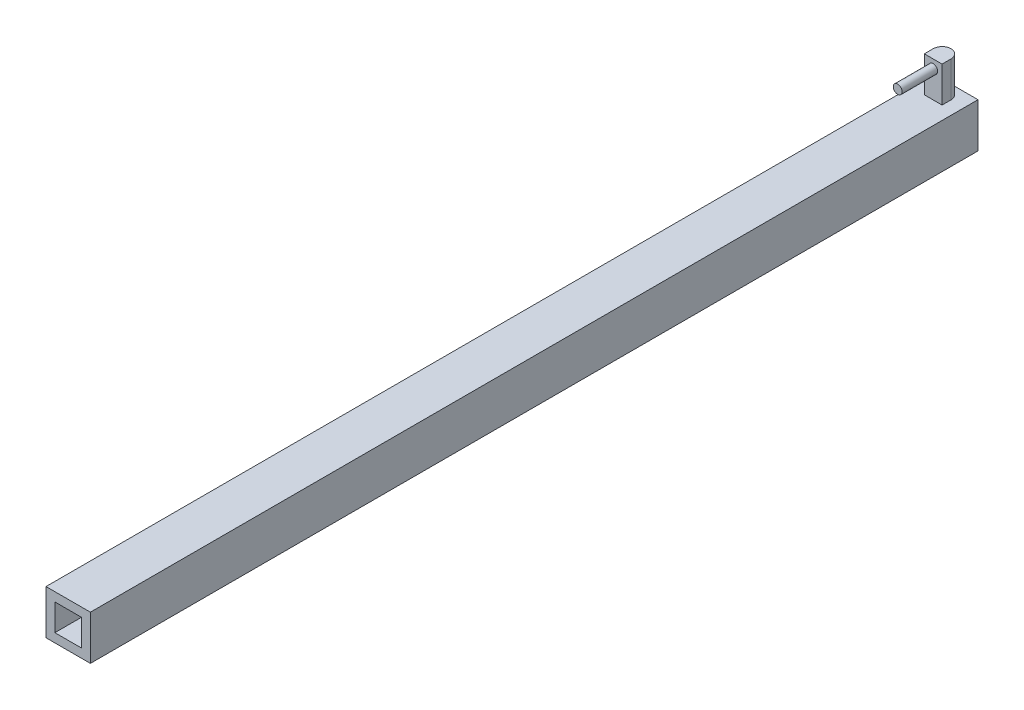
ISO-10303-21;
HEADER;
FILE_DESCRIPTION(('STEP AP214'),'2;1');
FILE_NAME('part.step','',(''),(''),'','','');
FILE_SCHEMA(('AUTOMOTIVE_DESIGN { 1 0 10303 214 1 1 1 1 }'));
ENDSEC;
DATA;
#1=APPLICATION_CONTEXT('core data for automotive mechanical design processes');
#2=APPLICATION_PROTOCOL_DEFINITION('international standard','automotive_design',2000,#1);
#3=PRODUCT_CONTEXT('',#1,'mechanical');
#4=PRODUCT('Part','Part','',(#3));
#5=PRODUCT_RELATED_PRODUCT_CATEGORY('part','',(#4));
#6=PRODUCT_DEFINITION_FORMATION('','',#4);
#7=PRODUCT_DEFINITION_CONTEXT('part definition',#1,'design');
#8=PRODUCT_DEFINITION('design','',#6,#7);
#9=PRODUCT_DEFINITION_SHAPE('','',#8);
#10=(LENGTH_UNIT() NAMED_UNIT(*) SI_UNIT(.MILLI.,.METRE.));
#11=(NAMED_UNIT(*) PLANE_ANGLE_UNIT() SI_UNIT($,.RADIAN.));
#12=(NAMED_UNIT(*) SI_UNIT($,.STERADIAN.) SOLID_ANGLE_UNIT());
#13=UNCERTAINTY_MEASURE_WITH_UNIT(LENGTH_MEASURE(1.E-05),#10,'distance_accuracy_value','');
#14=(GEOMETRIC_REPRESENTATION_CONTEXT(3) GLOBAL_UNCERTAINTY_ASSIGNED_CONTEXT((#13)) GLOBAL_UNIT_ASSIGNED_CONTEXT((#10,
#11,#12)) REPRESENTATION_CONTEXT('',''));
#15=CARTESIAN_POINT('',(0.,0.,0.));
#16=DIRECTION('',(0.,0.,1.));
#17=DIRECTION('',(1.,0.,0.));
#18=AXIS2_PLACEMENT_3D('',#15,#16,#17);
#19=CARTESIAN_POINT('',(-12.5,12.5,500.));
#20=DIRECTION('',(0.,-1.,0.));
#21=DIRECTION('',(0.,0.,-1.));
#22=AXIS2_PLACEMENT_3D('',#19,#20,#21);
#23=PLANE('',#22);
#24=DIRECTION('',(-1.,0.,0.));
#25=VECTOR('',#24,1.);
#26=CARTESIAN_POINT('',(-12.5,12.5,0.));
#27=LINE('',#26,#25);
#28=CARTESIAN_POINT('',(12.5,12.5,0.));
#29=VERTEX_POINT('',#28);
#30=CARTESIAN_POINT('',(-12.5,12.5,0.));
#31=VERTEX_POINT('',#30);
#32=EDGE_CURVE('E219',#29,#31,#27,.T.);
#33=ORIENTED_EDGE('',*,*,#32,.T.);
#34=DIRECTION('',(0.,0.,-1.));
#35=VECTOR('',#34,1.);
#36=CARTESIAN_POINT('',(-12.5,12.5,500.));
#37=LINE('',#36,#35);
#38=CARTESIAN_POINT('',(-12.5,12.5,500.));
#39=VERTEX_POINT('',#38);
#40=EDGE_CURVE('E228',#39,#31,#37,.T.);
#41=ORIENTED_EDGE('',*,*,#40,.F.);
#42=DIRECTION('',(-1.,0.,0.));
#43=VECTOR('',#42,1.);
#44=CARTESIAN_POINT('',(-12.5,12.5,500.));
#45=LINE('',#44,#43);
#46=CARTESIAN_POINT('',(12.5,12.5,500.));
#47=VERTEX_POINT('',#46);
#48=EDGE_CURVE('E225',#47,#39,#45,.T.);
#49=ORIENTED_EDGE('',*,*,#48,.F.);
#50=DIRECTION('',(0.,0.,-1.));
#51=VECTOR('',#50,1.);
#52=CARTESIAN_POINT('',(12.5,12.5,500.));
#53=LINE('',#52,#51);
#54=EDGE_CURVE('E243',#47,#29,#53,.T.);
#55=ORIENTED_EDGE('',*,*,#54,.T.);
#56=EDGE_LOOP('',(#33,#41,#49,#55));
#57=FACE_BOUND('',#56,.T.);
#58=DIRECTION('',(0.,0.,-1.));
#59=VECTOR('',#58,1.);
#60=CARTESIAN_POINT('',(5.,12.5,12.731161072987));
#61=LINE('',#60,#59);
#62=CARTESIAN_POINT('',(5.,12.5,12.731161072987));
#63=VERTEX_POINT('',#62);
#64=CARTESIAN_POINT('',(5.,12.5,7.73116107298702));
#65=VERTEX_POINT('',#64);
#66=EDGE_CURVE('E161',#63,#65,#61,.T.);
#67=ORIENTED_EDGE('',*,*,#66,.F.);
#68=DIRECTION('',(1.,0.,0.));
#69=VECTOR('',#68,1.);
#70=CARTESIAN_POINT('',(-5.,12.5,12.731161072987));
#71=LINE('',#70,#69);
#72=CARTESIAN_POINT('',(-5.,12.5,12.731161072987));
#73=VERTEX_POINT('',#72);
#74=EDGE_CURVE('E168',#73,#63,#71,.T.);
#75=ORIENTED_EDGE('',*,*,#74,.F.);
#76=DIRECTION('',(0.,0.,1.));
#77=VECTOR('',#76,1.);
#78=CARTESIAN_POINT('',(-5.,12.5,12.731161072987));
#79=LINE('',#78,#77);
#80=CARTESIAN_POINT('',(-5.,12.5,7.73116107298702));
#81=VERTEX_POINT('',#80);
#82=EDGE_CURVE('E144',#81,#73,#79,.T.);
#83=ORIENTED_EDGE('',*,*,#82,.F.);
#84=CARTESIAN_POINT('',(0.,12.5,7.73116107298702));
#85=DIRECTION('',(0.,-1.,0.));
#86=DIRECTION('',(0.,0.,-1.));
#87=AXIS2_PLACEMENT_3D('',#84,#85,#86);
#88=CIRCLE('',#87,5.);
#89=CARTESIAN_POINT('',(0.,12.5,2.73116107298702));
#90=VERTEX_POINT('',#89);
#91=EDGE_CURVE('E11',#81,#90,#88,.T.);
#92=ORIENTED_EDGE('',*,*,#91,.T.);
#93=CARTESIAN_POINT('',(0.,12.5,7.73116107298702));
#94=DIRECTION('',(0.,-1.,0.));
#95=DIRECTION('',(0.,0.,-1.));
#96=AXIS2_PLACEMENT_3D('',#93,#94,#95);
#97=CIRCLE('',#96,5.);
#98=EDGE_CURVE('E268',#90,#65,#97,.T.);
#99=ORIENTED_EDGE('',*,*,#98,.T.);
#100=EDGE_LOOP('',(#67,#75,#83,#92,#99));
#101=FACE_BOUND('',#100,.T.);
#102=ADVANCED_FACE('F38',(#57,#101),#23,.F.);
#103=CARTESIAN_POINT('',(0.,0.,500.));
#104=DIRECTION('',(0.,0.,-1.));
#105=DIRECTION('',(-1.,0.,0.));
#106=AXIS2_PLACEMENT_3D('',#103,#104,#105);
#107=PLANE('',#106);
#108=DIRECTION('',(0.,-1.,0.));
#109=VECTOR('',#108,1.);
#110=CARTESIAN_POINT('',(-12.5,-12.5,500.));
#111=LINE('',#110,#109);
#112=CARTESIAN_POINT('',(-12.5,-12.5,500.));
#113=VERTEX_POINT('',#112);
#114=EDGE_CURVE('E214',#39,#113,#111,.T.);
#115=ORIENTED_EDGE('',*,*,#114,.T.);
#116=DIRECTION('',(1.,0.,0.));
#117=VECTOR('',#116,1.);
#118=CARTESIAN_POINT('',(-12.5,-12.5,500.));
#119=LINE('',#118,#117);
#120=CARTESIAN_POINT('',(12.5,-12.5,500.));
#121=VERTEX_POINT('',#120);
#122=EDGE_CURVE('E218',#113,#121,#119,.T.);
#123=ORIENTED_EDGE('',*,*,#122,.T.);
#124=DIRECTION('',(0.,1.,0.));
#125=VECTOR('',#124,1.);
#126=CARTESIAN_POINT('',(12.5,-12.5,500.));
#127=LINE('',#126,#125);
#128=EDGE_CURVE('E222',#121,#47,#127,.T.);
#129=ORIENTED_EDGE('',*,*,#128,.T.);
#130=ORIENTED_EDGE('',*,*,#48,.T.);
#131=EDGE_LOOP('',(#115,#123,#129,#130));
#132=FACE_BOUND('',#131,.T.);
#133=DIRECTION('',(0.,1.,0.));
#134=VECTOR('',#133,1.);
#135=CARTESIAN_POINT('',(7.5,-7.5,500.));
#136=LINE('',#135,#134);
#137=CARTESIAN_POINT('',(7.5,-7.5,500.));
#138=VERTEX_POINT('',#137);
#139=CARTESIAN_POINT('',(7.5,7.5,500.));
#140=VERTEX_POINT('',#139);
#141=EDGE_CURVE('E171',#138,#140,#136,.T.);
#142=ORIENTED_EDGE('',*,*,#141,.F.);
#143=DIRECTION('',(1.,0.,0.));
#144=VECTOR('',#143,1.);
#145=CARTESIAN_POINT('',(-7.5,-7.5,500.));
#146=LINE('',#145,#144);
#147=CARTESIAN_POINT('',(-7.5,-7.5,500.));
#148=VERTEX_POINT('',#147);
#149=EDGE_CURVE('E182',#148,#138,#146,.T.);
#150=ORIENTED_EDGE('',*,*,#149,.F.);
#151=DIRECTION('',(0.,-1.,0.));
#152=VECTOR('',#151,1.);
#153=CARTESIAN_POINT('',(-7.5,-7.5,500.));
#154=LINE('',#153,#152);
#155=CARTESIAN_POINT('',(-7.5,7.5,500.));
#156=VERTEX_POINT('',#155);
#157=EDGE_CURVE('E178',#156,#148,#154,.T.);
#158=ORIENTED_EDGE('',*,*,#157,.F.);
#159=DIRECTION('',(-1.,0.,0.));
#160=VECTOR('',#159,1.);
#161=CARTESIAN_POINT('',(-7.5,7.5,500.));
#162=LINE('',#161,#160);
#163=EDGE_CURVE('E174',#140,#156,#162,.T.);
#164=ORIENTED_EDGE('',*,*,#163,.F.);
#165=EDGE_LOOP('',(#142,#150,#158,#164));
#166=FACE_BOUND('',#165,.T.);
#167=ADVANCED_FACE('F326',(#132,#166),#107,.F.);
#168=CARTESIAN_POINT('',(0.,0.,0.));
#169=DIRECTION('',(0.,0.,-1.));
#170=DIRECTION('',(-1.,0.,0.));
#171=AXIS2_PLACEMENT_3D('',#168,#169,#170);
#172=PLANE('',#171);
#173=DIRECTION('',(0.,-1.,0.));
#174=VECTOR('',#173,1.);
#175=CARTESIAN_POINT('',(-12.5,-12.5,0.));
#176=LINE('',#175,#174);
#177=CARTESIAN_POINT('',(-12.5,-12.5,0.));
#178=VERTEX_POINT('',#177);
#179=EDGE_CURVE('E213',#31,#178,#176,.T.);
#180=ORIENTED_EDGE('',*,*,#179,.F.);
#181=ORIENTED_EDGE('',*,*,#32,.F.);
#182=DIRECTION('',(0.,1.,0.));
#183=VECTOR('',#182,1.);
#184=CARTESIAN_POINT('',(12.5,-12.5,0.));
#185=LINE('',#184,#183);
#186=CARTESIAN_POINT('',(12.5,-12.5,0.));
#187=VERTEX_POINT('',#186);
#188=EDGE_CURVE('E235',#187,#29,#185,.T.);
#189=ORIENTED_EDGE('',*,*,#188,.F.);
#190=DIRECTION('',(1.,0.,0.));
#191=VECTOR('',#190,1.);
#192=CARTESIAN_POINT('',(-12.5,-12.5,0.));
#193=LINE('',#192,#191);
#194=EDGE_CURVE('E232',#178,#187,#193,.T.);
#195=ORIENTED_EDGE('',*,*,#194,.F.);
#196=EDGE_LOOP('',(#180,#181,#189,#195));
#197=FACE_BOUND('',#196,.T.);
#198=DIRECTION('',(1.,0.,0.));
#199=VECTOR('',#198,1.);
#200=CARTESIAN_POINT('',(-7.5,-7.5,0.));
#201=LINE('',#200,#199);
#202=CARTESIAN_POINT('',(-7.5,-7.5,0.));
#203=VERTEX_POINT('',#202);
#204=CARTESIAN_POINT('',(7.5,-7.5,0.));
#205=VERTEX_POINT('',#204);
#206=EDGE_CURVE('E175',#203,#205,#201,.T.);
#207=ORIENTED_EDGE('',*,*,#206,.T.);
#208=DIRECTION('',(0.,1.,0.));
#209=VECTOR('',#208,1.);
#210=CARTESIAN_POINT('',(7.5,-7.5,0.));
#211=LINE('',#210,#209);
#212=CARTESIAN_POINT('',(7.5,7.5,0.));
#213=VERTEX_POINT('',#212);
#214=EDGE_CURVE('E149',#205,#213,#211,.T.);
#215=ORIENTED_EDGE('',*,*,#214,.T.);
#216=DIRECTION('',(-1.,0.,0.));
#217=VECTOR('',#216,1.);
#218=CARTESIAN_POINT('',(-7.5,7.5,0.));
#219=LINE('',#218,#217);
#220=CARTESIAN_POINT('',(-7.5,7.5,0.));
#221=VERTEX_POINT('',#220);
#222=EDGE_CURVE('E189',#213,#221,#219,.T.);
#223=ORIENTED_EDGE('',*,*,#222,.T.);
#224=DIRECTION('',(0.,-1.,0.));
#225=VECTOR('',#224,1.);
#226=CARTESIAN_POINT('',(-7.5,-7.5,0.));
#227=LINE('',#226,#225);
#228=EDGE_CURVE('E193',#221,#203,#227,.T.);
#229=ORIENTED_EDGE('',*,*,#228,.T.);
#230=EDGE_LOOP('',(#207,#215,#223,#229));
#231=FACE_BOUND('',#230,.T.);
#232=ADVANCED_FACE('F318',(#197,#231),#172,.T.);
#233=CARTESIAN_POINT('',(-12.5,-12.5,500.));
#234=DIRECTION('',(1.,0.,0.));
#235=DIRECTION('',(0.,0.,-1.));
#236=AXIS2_PLACEMENT_3D('',#233,#234,#235);
#237=PLANE('',#236);
#238=ORIENTED_EDGE('',*,*,#179,.T.);
#239=DIRECTION('',(0.,0.,-1.));
#240=VECTOR('',#239,1.);
#241=CARTESIAN_POINT('',(-12.5,-12.5,500.));
#242=LINE('',#241,#240);
#243=EDGE_CURVE('E251',#113,#178,#242,.T.);
#244=ORIENTED_EDGE('',*,*,#243,.F.);
#245=ORIENTED_EDGE('',*,*,#114,.F.);
#246=ORIENTED_EDGE('',*,*,#40,.T.);
#247=EDGE_LOOP('',(#238,#244,#245,#246));
#248=FACE_BOUND('',#247,.T.);
#249=ADVANCED_FACE('F307',(#248),#237,.F.);
#250=CARTESIAN_POINT('',(-12.5,-12.5,500.));
#251=DIRECTION('',(0.,1.,0.));
#252=DIRECTION('',(0.,0.,1.));
#253=AXIS2_PLACEMENT_3D('',#250,#251,#252);
#254=PLANE('',#253);
#255=CARTESIAN_POINT('',(0.,-12.5,70.9867440526172));
#256=DIRECTION('',(0.,-1.,0.));
#257=DIRECTION('',(0.,0.,-1.));
#258=AXIS2_PLACEMENT_3D('',#255,#256,#257);
#259=CIRCLE('',#258,4.5);
#260=CARTESIAN_POINT('',(0.,-12.5,66.4867440526172));
#261=VERTEX_POINT('',#260);
#262=EDGE_CURVE('E286',#261,#261,#259,.T.);
#263=ORIENTED_EDGE('',*,*,#262,.F.);
#264=EDGE_LOOP('',(#263));
#265=FACE_BOUND('',#264,.T.);
#266=ORIENTED_EDGE('',*,*,#194,.T.);
#267=DIRECTION('',(0.,0.,-1.));
#268=VECTOR('',#267,1.);
#269=CARTESIAN_POINT('',(12.5,-12.5,500.));
#270=LINE('',#269,#268);
#271=EDGE_CURVE('E247',#121,#187,#270,.T.);
#272=ORIENTED_EDGE('',*,*,#271,.F.);
#273=ORIENTED_EDGE('',*,*,#122,.F.);
#274=ORIENTED_EDGE('',*,*,#243,.T.);
#275=EDGE_LOOP('',(#266,#272,#273,#274));
#276=FACE_BOUND('',#275,.T.);
#277=ADVANCED_FACE('F303',(#265,#276),#254,.F.);
#278=CARTESIAN_POINT('',(12.5,-12.5,500.));
#279=DIRECTION('',(-1.,0.,0.));
#280=DIRECTION('',(0.,0.,1.));
#281=AXIS2_PLACEMENT_3D('',#278,#279,#280);
#282=PLANE('',#281);
#283=ORIENTED_EDGE('',*,*,#188,.T.);
#284=ORIENTED_EDGE('',*,*,#54,.F.);
#285=ORIENTED_EDGE('',*,*,#128,.F.);
#286=ORIENTED_EDGE('',*,*,#271,.T.);
#287=EDGE_LOOP('',(#283,#284,#285,#286));
#288=FACE_BOUND('',#287,.T.);
#289=ADVANCED_FACE('F306',(#288),#282,.F.);
#290=CARTESIAN_POINT('',(7.5,-7.5,500.));
#291=DIRECTION('',(-1.,0.,0.));
#292=DIRECTION('',(0.,0.,1.));
#293=AXIS2_PLACEMENT_3D('',#290,#291,#292);
#294=PLANE('',#293);
#295=ORIENTED_EDGE('',*,*,#214,.F.);
#296=DIRECTION('',(0.,0.,-1.));
#297=VECTOR('',#296,1.);
#298=CARTESIAN_POINT('',(7.5,-7.5,500.));
#299=LINE('',#298,#297);
#300=EDGE_CURVE('E185',#138,#205,#299,.T.);
#301=ORIENTED_EDGE('',*,*,#300,.F.);
#302=ORIENTED_EDGE('',*,*,#141,.T.);
#303=DIRECTION('',(0.,0.,-1.));
#304=VECTOR('',#303,1.);
#305=CARTESIAN_POINT('',(7.5,7.5,500.));
#306=LINE('',#305,#304);
#307=EDGE_CURVE('E209',#140,#213,#306,.T.);
#308=ORIENTED_EDGE('',*,*,#307,.T.);
#309=EDGE_LOOP('',(#295,#301,#302,#308));
#310=FACE_BOUND('',#309,.T.);
#311=ADVANCED_FACE('F337',(#310),#294,.T.);
#312=CARTESIAN_POINT('',(-7.5,7.5,500.));
#313=DIRECTION('',(0.,-1.,0.));
#314=DIRECTION('',(0.,0.,-1.));
#315=AXIS2_PLACEMENT_3D('',#312,#313,#314);
#316=PLANE('',#315);
#317=ORIENTED_EDGE('',*,*,#222,.F.);
#318=ORIENTED_EDGE('',*,*,#307,.F.);
#319=ORIENTED_EDGE('',*,*,#163,.T.);
#320=DIRECTION('',(0.,0.,-1.));
#321=VECTOR('',#320,1.);
#322=CARTESIAN_POINT('',(-7.5,7.5,500.));
#323=LINE('',#322,#321);
#324=EDGE_CURVE('E206',#156,#221,#323,.T.);
#325=ORIENTED_EDGE('',*,*,#324,.T.);
#326=EDGE_LOOP('',(#317,#318,#319,#325));
#327=FACE_BOUND('',#326,.T.);
#328=ADVANCED_FACE('F339',(#327),#316,.T.);
#329=CARTESIAN_POINT('',(-7.5,-7.5,500.));
#330=DIRECTION('',(1.,0.,0.));
#331=DIRECTION('',(0.,0.,-1.));
#332=AXIS2_PLACEMENT_3D('',#329,#330,#331);
#333=PLANE('',#332);
#334=ORIENTED_EDGE('',*,*,#228,.F.);
#335=ORIENTED_EDGE('',*,*,#324,.F.);
#336=ORIENTED_EDGE('',*,*,#157,.T.);
#337=DIRECTION('',(0.,0.,-1.));
#338=VECTOR('',#337,1.);
#339=CARTESIAN_POINT('',(-7.5,-7.5,500.));
#340=LINE('',#339,#338);
#341=EDGE_CURVE('E203',#148,#203,#340,.T.);
#342=ORIENTED_EDGE('',*,*,#341,.T.);
#343=EDGE_LOOP('',(#334,#335,#336,#342));
#344=FACE_BOUND('',#343,.T.);
#345=ADVANCED_FACE('F344',(#344),#333,.T.);
#346=CARTESIAN_POINT('',(-7.5,-7.5,500.));
#347=DIRECTION('',(0.,1.,0.));
#348=DIRECTION('',(0.,0.,1.));
#349=AXIS2_PLACEMENT_3D('',#346,#347,#348);
#350=PLANE('',#349);
#351=CARTESIAN_POINT('',(0.,-7.5,70.9867440526172));
#352=DIRECTION('',(0.,-1.,0.));
#353=DIRECTION('',(0.,0.,-1.));
#354=AXIS2_PLACEMENT_3D('',#351,#352,#353);
#355=CIRCLE('',#354,4.5);
#356=CARTESIAN_POINT('',(0.,-7.5,66.4867440526172));
#357=VERTEX_POINT('',#356);
#358=EDGE_CURVE('E285',#357,#357,#355,.T.);
#359=ORIENTED_EDGE('',*,*,#358,.T.);
#360=EDGE_LOOP('',(#359));
#361=FACE_BOUND('',#360,.T.);
#362=ORIENTED_EDGE('',*,*,#206,.F.);
#363=ORIENTED_EDGE('',*,*,#341,.F.);
#364=ORIENTED_EDGE('',*,*,#149,.T.);
#365=ORIENTED_EDGE('',*,*,#300,.T.);
#366=EDGE_LOOP('',(#362,#363,#364,#365));
#367=FACE_BOUND('',#366,.T.);
#368=ADVANCED_FACE('F294',(#361,#367),#350,.T.);
#369=CARTESIAN_POINT('',(5.,32.5,12.731161072987));
#370=DIRECTION('',(-1.,0.,0.));
#371=DIRECTION('',(0.,0.,1.));
#372=AXIS2_PLACEMENT_3D('',#369,#370,#371);
#373=PLANE('',#372);
#374=ORIENTED_EDGE('',*,*,#66,.T.);
#375=DIRECTION('',(0.,-1.,0.));
#376=VECTOR('',#375,1.);
#377=CARTESIAN_POINT('',(5.,32.5,7.73116107298702));
#378=LINE('',#377,#376);
#379=CARTESIAN_POINT('',(5.,32.5,7.73116107298702));
#380=VERTEX_POINT('',#379);
#381=EDGE_CURVE('E262',#65,#380,#378,.F.);
#382=ORIENTED_EDGE('',*,*,#381,.T.);
#383=DIRECTION('',(0.,0.,-1.));
#384=VECTOR('',#383,1.);
#385=CARTESIAN_POINT('',(5.,32.5,12.731161072987));
#386=LINE('',#385,#384);
#387=CARTESIAN_POINT('',(5.,32.5,12.731161072987));
#388=VERTEX_POINT('',#387);
#389=EDGE_CURVE('E138',#388,#380,#386,.T.);
#390=ORIENTED_EDGE('',*,*,#389,.F.);
#391=DIRECTION('',(0.,-1.,0.));
#392=VECTOR('',#391,1.);
#393=CARTESIAN_POINT('',(5.,32.5,12.731161072987));
#394=LINE('',#393,#392);
#395=EDGE_CURVE('E150',#388,#63,#394,.T.);
#396=ORIENTED_EDGE('',*,*,#395,.T.);
#397=EDGE_LOOP('',(#374,#382,#390,#396));
#398=FACE_BOUND('',#397,.T.);
#399=ADVANCED_FACE('F277',(#398),#373,.F.);
#400=CARTESIAN_POINT('',(-5.,32.5,12.731161072987));
#401=DIRECTION('',(1.,0.,0.));
#402=DIRECTION('',(0.,0.,-1.));
#403=AXIS2_PLACEMENT_3D('',#400,#401,#402);
#404=PLANE('',#403);
#405=DIRECTION('',(0.,0.,1.));
#406=VECTOR('',#405,1.);
#407=CARTESIAN_POINT('',(-5.,32.5,12.731161072987));
#408=LINE('',#407,#406);
#409=CARTESIAN_POINT('',(-5.,32.5,7.73116107298702));
#410=VERTEX_POINT('',#409);
#411=CARTESIAN_POINT('',(-5.,32.5,12.731161072987));
#412=VERTEX_POINT('',#411);
#413=EDGE_CURVE('E129',#410,#412,#408,.T.);
#414=ORIENTED_EDGE('',*,*,#413,.F.);
#415=DIRECTION('',(0.,-1.,0.));
#416=VECTOR('',#415,1.);
#417=CARTESIAN_POINT('',(-5.,32.5,7.73116107298702));
#418=LINE('',#417,#416);
#419=EDGE_CURVE('E271',#410,#81,#418,.T.);
#420=ORIENTED_EDGE('',*,*,#419,.T.);
#421=ORIENTED_EDGE('',*,*,#82,.T.);
#422=DIRECTION('',(0.,-1.,0.));
#423=VECTOR('',#422,1.);
#424=CARTESIAN_POINT('',(-5.,32.5,12.731161072987));
#425=LINE('',#424,#423);
#426=EDGE_CURVE('E141',#412,#73,#425,.T.);
#427=ORIENTED_EDGE('',*,*,#426,.F.);
#428=EDGE_LOOP('',(#414,#420,#421,#427));
#429=FACE_BOUND('',#428,.T.);
#430=ADVANCED_FACE('F142',(#429),#404,.F.);
#431=CARTESIAN_POINT('',(-5.,32.5,12.731161072987));
#432=DIRECTION('',(0.,0.,-1.));
#433=DIRECTION('',(-1.,0.,0.));
#434=AXIS2_PLACEMENT_3D('',#431,#432,#433);
#435=PLANE('',#434);
#436=CARTESIAN_POINT('',(0.,27.7070808488402,12.731161072987));
#437=DIRECTION('',(0.,0.,-1.));
#438=DIRECTION('',(-1.,0.,0.));
#439=AXIS2_PLACEMENT_3D('',#436,#437,#438);
#440=CIRCLE('',#439,2.5);
#441=CARTESIAN_POINT('',(-2.5,27.7070808488402,12.731161072987));
#442=VERTEX_POINT('',#441);
#443=EDGE_CURVE('E255',#442,#442,#440,.F.);
#444=ORIENTED_EDGE('',*,*,#443,.F.);
#445=EDGE_LOOP('',(#444));
#446=FACE_BOUND('',#445,.T.);
#447=ORIENTED_EDGE('',*,*,#74,.T.);
#448=ORIENTED_EDGE('',*,*,#395,.F.);
#449=DIRECTION('',(1.,0.,0.));
#450=VECTOR('',#449,1.);
#451=CARTESIAN_POINT('',(-5.,32.5,12.731161072987));
#452=LINE('',#451,#450);
#453=EDGE_CURVE('E134',#412,#388,#452,.T.);
#454=ORIENTED_EDGE('',*,*,#453,.F.);
#455=ORIENTED_EDGE('',*,*,#426,.T.);
#456=EDGE_LOOP('',(#447,#448,#454,#455));
#457=FACE_BOUND('',#456,.T.);
#458=ADVANCED_FACE('F152',(#446,#457),#435,.F.);
#459=CARTESIAN_POINT('',(0.,32.5,0.));
#460=DIRECTION('',(0.,-1.,0.));
#461=DIRECTION('',(0.,0.,-1.));
#462=AXIS2_PLACEMENT_3D('',#459,#460,#461);
#463=PLANE('',#462);
#464=CARTESIAN_POINT('',(0.,32.5,7.73116107298702));
#465=DIRECTION('',(0.,-1.,0.));
#466=DIRECTION('',(0.,0.,-1.));
#467=AXIS2_PLACEMENT_3D('',#464,#465,#466);
#468=CIRCLE('',#467,5.);
#469=CARTESIAN_POINT('',(0.,32.5,2.73116107298702));
#470=VERTEX_POINT('',#469);
#471=EDGE_CURVE('E265',#380,#470,#468,.F.);
#472=ORIENTED_EDGE('',*,*,#471,.T.);
#473=CARTESIAN_POINT('',(0.,32.5,7.73116107298702));
#474=DIRECTION('',(0.,-1.,0.));
#475=DIRECTION('',(0.,0.,-1.));
#476=AXIS2_PLACEMENT_3D('',#473,#474,#475);
#477=CIRCLE('',#476,5.);
#478=EDGE_CURVE('E47',#470,#410,#477,.F.);
#479=ORIENTED_EDGE('',*,*,#478,.T.);
#480=ORIENTED_EDGE('',*,*,#413,.T.);
#481=ORIENTED_EDGE('',*,*,#453,.T.);
#482=ORIENTED_EDGE('',*,*,#389,.T.);
#483=EDGE_LOOP('',(#472,#479,#480,#481,#482));
#484=FACE_BOUND('',#483,.T.);
#485=ADVANCED_FACE('F131',(#484),#463,.F.);
#486=CARTESIAN_POINT('',(0.,27.7070808488402,32.731161072987));
#487=DIRECTION('',(0.,0.,-1.));
#488=DIRECTION('',(-1.,0.,0.));
#489=AXIS2_PLACEMENT_3D('',#486,#487,#488);
#490=CYLINDRICAL_SURFACE('',#489,2.5);
#491=CARTESIAN_POINT('',(0.,27.7070808488402,32.731161072987));
#492=DIRECTION('',(0.,0.,1.));
#493=DIRECTION('',(1.,0.,0.));
#494=AXIS2_PLACEMENT_3D('',#491,#492,#493);
#495=CIRCLE('',#494,2.5);
#496=CARTESIAN_POINT('',(2.5,27.7070808488402,32.731161072987));
#497=VERTEX_POINT('',#496);
#498=EDGE_CURVE('E165',#497,#497,#495,.T.);
#499=ORIENTED_EDGE('',*,*,#498,.F.);
#500=EDGE_LOOP('',(#499));
#501=FACE_BOUND('',#500,.T.);
#502=ORIENTED_EDGE('',*,*,#443,.T.);
#503=EDGE_LOOP('',(#502));
#504=FACE_BOUND('',#503,.T.);
#505=ADVANCED_FACE('F373',(#501,#504),#490,.T.);
#506=CARTESIAN_POINT('',(0.,27.7070808488402,32.731161072987));
#507=DIRECTION('',(0.,0.,1.));
#508=DIRECTION('',(1.,0.,0.));
#509=AXIS2_PLACEMENT_3D('',#506,#507,#508);
#510=PLANE('',#509);
#511=ORIENTED_EDGE('',*,*,#498,.T.);
#512=EDGE_LOOP('',(#511));
#513=FACE_BOUND('',#512,.T.);
#514=ADVANCED_FACE('F367',(#513),#510,.T.);
#515=CARTESIAN_POINT('',(0.,32.5,7.73116107298702));
#516=DIRECTION('',(0.,-1.,0.));
#517=DIRECTION('',(0.,0.,-1.));
#518=AXIS2_PLACEMENT_3D('',#515,#516,#517);
#519=CYLINDRICAL_SURFACE('',#518,5.);
#520=ORIENTED_EDGE('',*,*,#471,.F.);
#521=ORIENTED_EDGE('',*,*,#381,.F.);
#522=ORIENTED_EDGE('',*,*,#98,.F.);
#523=DIRECTION('',(0.,-1.,0.));
#524=VECTOR('',#523,1.);
#525=CARTESIAN_POINT('',(0.,32.5,2.73116107298702));
#526=LINE('',#525,#524);
#527=EDGE_CURVE('E259',#470,#90,#526,.T.);
#528=ORIENTED_EDGE('',*,*,#527,.F.);
#529=EDGE_LOOP('',(#520,#521,#522,#528));
#530=FACE_BOUND('',#529,.T.);
#531=ADVANCED_FACE('F365',(#530),#519,.T.);
#532=CARTESIAN_POINT('',(0.,32.5,7.73116107298702));
#533=DIRECTION('',(0.,-1.,0.));
#534=DIRECTION('',(0.,0.,-1.));
#535=AXIS2_PLACEMENT_3D('',#532,#533,#534);
#536=CYLINDRICAL_SURFACE('',#535,5.);
#537=ORIENTED_EDGE('',*,*,#478,.F.);
#538=ORIENTED_EDGE('',*,*,#527,.T.);
#539=ORIENTED_EDGE('',*,*,#91,.F.);
#540=ORIENTED_EDGE('',*,*,#419,.F.);
#541=EDGE_LOOP('',(#537,#538,#539,#540));
#542=FACE_BOUND('',#541,.T.);
#543=ADVANCED_FACE('F40',(#542),#536,.T.);
#544=CARTESIAN_POINT('',(0.,-7.5,70.9867440526172));
#545=DIRECTION('',(0.,-1.,0.));
#546=DIRECTION('',(0.,0.,-1.));
#547=AXIS2_PLACEMENT_3D('',#544,#545,#546);
#548=CYLINDRICAL_SURFACE('',#547,4.5);
#549=ORIENTED_EDGE('',*,*,#358,.F.);
#550=EDGE_LOOP('',(#549));
#551=FACE_BOUND('',#550,.T.);
#552=ORIENTED_EDGE('',*,*,#262,.T.);
#553=EDGE_LOOP('',(#552));
#554=FACE_BOUND('',#553,.T.);
#555=ADVANCED_FACE('F297',(#551,#554),#548,.F.);
#556=CLOSED_SHELL('',(#102,#167,#232,#249,#277,#289,#311,#328,#345,#368,#399,#430,#458,#485,
#505,#514,#531,#543,#555));
#557=MANIFOLD_SOLID_BREP('B2',#556);
#558=ADVANCED_BREP_SHAPE_REPRESENTATION('',(#18,#557),#14);
#559=SHAPE_DEFINITION_REPRESENTATION(#9,#558);
ENDSEC;
END-ISO-10303-21;
